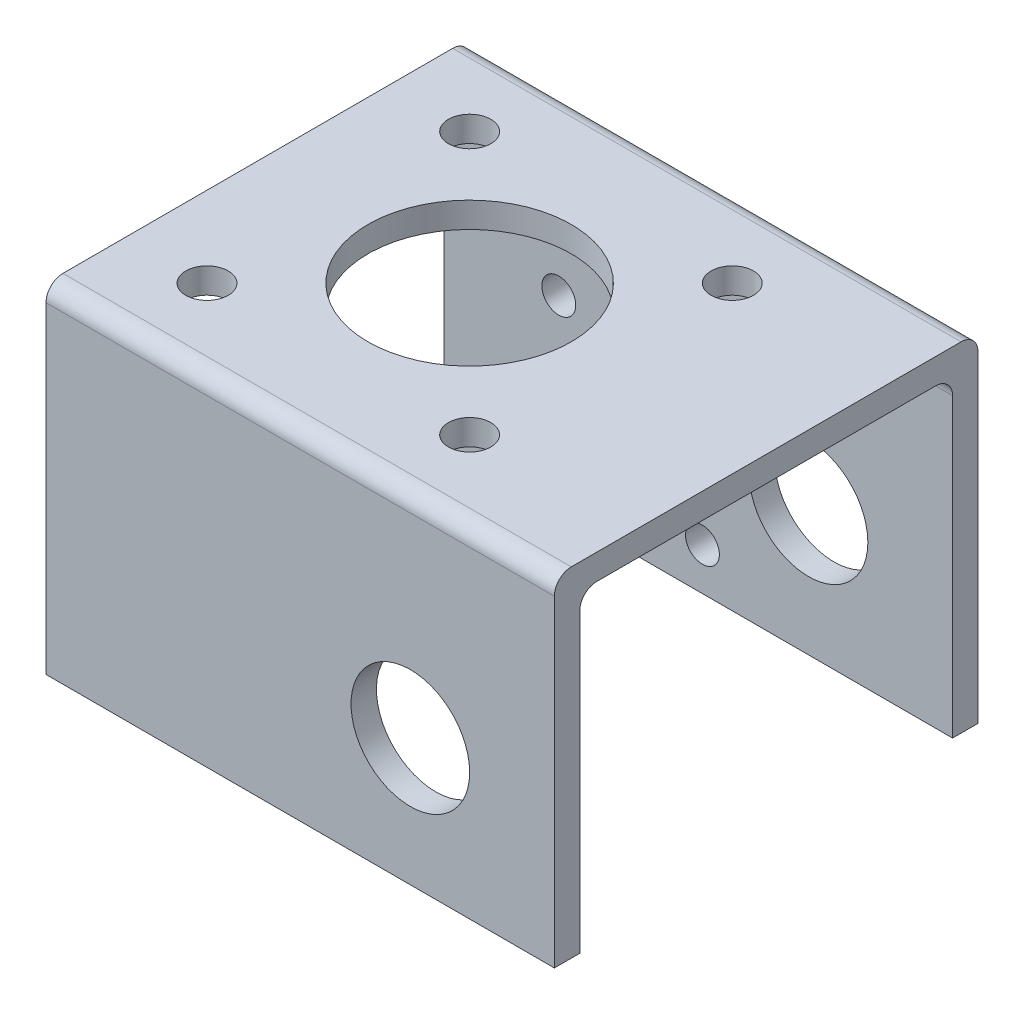
ISO-10303-21;
HEADER;
FILE_DESCRIPTION(('STEP AP214'),'2;1');
FILE_NAME('part.step','',(''),(''),'','','');
FILE_SCHEMA(('AUTOMOTIVE_DESIGN { 1 0 10303 214 1 1 1 1 }'));
ENDSEC;
DATA;
#1=APPLICATION_CONTEXT('core data for automotive mechanical design processes');
#2=APPLICATION_PROTOCOL_DEFINITION('international standard','automotive_design',2000,#1);
#3=PRODUCT_CONTEXT('',#1,'mechanical');
#4=PRODUCT('Part','Part','',(#3));
#5=PRODUCT_RELATED_PRODUCT_CATEGORY('part','',(#4));
#6=PRODUCT_DEFINITION_FORMATION('','',#4);
#7=PRODUCT_DEFINITION_CONTEXT('part definition',#1,'design');
#8=PRODUCT_DEFINITION('design','',#6,#7);
#9=PRODUCT_DEFINITION_SHAPE('','',#8);
#10=(LENGTH_UNIT() NAMED_UNIT(*) SI_UNIT(.MILLI.,.METRE.));
#11=(NAMED_UNIT(*) PLANE_ANGLE_UNIT() SI_UNIT($,.RADIAN.));
#12=(NAMED_UNIT(*) SI_UNIT($,.STERADIAN.) SOLID_ANGLE_UNIT());
#13=UNCERTAINTY_MEASURE_WITH_UNIT(LENGTH_MEASURE(1.E-05),#10,'distance_accuracy_value','');
#14=(GEOMETRIC_REPRESENTATION_CONTEXT(3) GLOBAL_UNCERTAINTY_ASSIGNED_CONTEXT((#13)) GLOBAL_UNIT_ASSIGNED_CONTEXT((#10,
#11,#12)) REPRESENTATION_CONTEXT('',''));
#15=CARTESIAN_POINT('',(0.,0.,0.));
#16=DIRECTION('',(0.,0.,1.));
#17=DIRECTION('',(1.,0.,0.));
#18=AXIS2_PLACEMENT_3D('',#15,#16,#17);
#19=CARTESIAN_POINT('',(60.,38.,0.));
#20=DIRECTION('',(0.,0.,-1.));
#21=DIRECTION('',(0.,1.,0.));
#22=AXIS2_PLACEMENT_3D('',#19,#20,#21);
#23=PLANE('',#22);
#24=CARTESIAN_POINT('',(43.,15.,0.));
#25=DIRECTION('',(0.,0.,1.));
#26=DIRECTION('',(1.,0.,0.));
#27=AXIS2_PLACEMENT_3D('',#24,#25,#26);
#28=CIRCLE('',#27,7.);
#29=CARTESIAN_POINT('',(50.,15.,0.));
#30=VERTEX_POINT('',#29);
#31=EDGE_CURVE('E262',#30,#30,#28,.T.);
#32=ORIENTED_EDGE('',*,*,#31,.F.);
#33=EDGE_LOOP('',(#32));
#34=FACE_BOUND('',#33,.T.);
#35=DIRECTION('',(0.,-1.,0.));
#36=VECTOR('',#35,1.);
#37=CARTESIAN_POINT('',(0.,38.,0.));
#38=LINE('',#37,#36);
#39=CARTESIAN_POINT('',(0.,38.,0.));
#40=VERTEX_POINT('',#39);
#41=CARTESIAN_POINT('',(0.,0.,0.));
#42=VERTEX_POINT('',#41);
#43=EDGE_CURVE('E153',#40,#42,#38,.T.);
#44=ORIENTED_EDGE('',*,*,#43,.T.);
#45=DIRECTION('',(-1.,0.,0.));
#46=VECTOR('',#45,1.);
#47=CARTESIAN_POINT('',(60.,0.,0.));
#48=LINE('',#47,#46);
#49=CARTESIAN_POINT('',(60.,0.,0.));
#50=VERTEX_POINT('',#49);
#51=EDGE_CURVE('E11',#50,#42,#48,.T.);
#52=ORIENTED_EDGE('',*,*,#51,.F.);
#53=DIRECTION('',(0.,-1.,0.));
#54=VECTOR('',#53,1.);
#55=CARTESIAN_POINT('',(60.,38.,0.));
#56=LINE('',#55,#54);
#57=CARTESIAN_POINT('',(60.,38.,0.));
#58=VERTEX_POINT('',#57);
#59=EDGE_CURVE('E176',#58,#50,#56,.T.);
#60=ORIENTED_EDGE('',*,*,#59,.F.);
#61=DIRECTION('',(-1.,0.,0.));
#62=VECTOR('',#61,1.);
#63=CARTESIAN_POINT('',(60.,38.,0.));
#64=LINE('',#63,#62);
#65=EDGE_CURVE('E149',#58,#40,#64,.T.);
#66=ORIENTED_EDGE('',*,*,#65,.T.);
#67=EDGE_LOOP('',(#44,#52,#60,#66));
#68=FACE_BOUND('',#67,.T.);
#69=ADVANCED_FACE('F33',(#34,#68),#23,.F.);
#70=CARTESIAN_POINT('',(60.,0.,0.));
#71=DIRECTION('',(0.,1.,0.));
#72=DIRECTION('',(0.,0.,1.));
#73=AXIS2_PLACEMENT_3D('',#70,#71,#72);
#74=PLANE('',#73);
#75=DIRECTION('',(0.,0.,-1.));
#76=VECTOR('',#75,1.);
#77=CARTESIAN_POINT('',(0.,0.,0.));
#78=LINE('',#77,#76);
#79=CARTESIAN_POINT('',(0.,0.,-3.));
#80=VERTEX_POINT('',#79);
#81=EDGE_CURVE('E156',#42,#80,#78,.T.);
#82=ORIENTED_EDGE('',*,*,#81,.T.);
#83=DIRECTION('',(-1.,0.,0.));
#84=VECTOR('',#83,1.);
#85=CARTESIAN_POINT('',(60.,0.,-3.));
#86=LINE('',#85,#84);
#87=CARTESIAN_POINT('',(60.,0.,-3.));
#88=VERTEX_POINT('',#87);
#89=EDGE_CURVE('E41',#88,#80,#86,.T.);
#90=ORIENTED_EDGE('',*,*,#89,.F.);
#91=DIRECTION('',(0.,0.,-1.));
#92=VECTOR('',#91,1.);
#93=CARTESIAN_POINT('',(60.,0.,0.));
#94=LINE('',#93,#92);
#95=EDGE_CURVE('E104',#50,#88,#94,.T.);
#96=ORIENTED_EDGE('',*,*,#95,.F.);
#97=ORIENTED_EDGE('',*,*,#51,.T.);
#98=EDGE_LOOP('',(#82,#90,#96,#97));
#99=FACE_BOUND('',#98,.T.);
#100=ADVANCED_FACE('F255',(#99),#74,.F.);
#101=CARTESIAN_POINT('',(60.,0.,-3.));
#102=DIRECTION('',(0.,0.,1.));
#103=DIRECTION('',(0.,-1.,0.));
#104=AXIS2_PLACEMENT_3D('',#101,#102,#103);
#105=PLANE('',#104);
#106=CARTESIAN_POINT('',(43.,15.,-3.));
#107=DIRECTION('',(0.,0.,1.));
#108=DIRECTION('',(0.,-1.,0.));
#109=AXIS2_PLACEMENT_3D('',#106,#107,#108);
#110=CIRCLE('',#109,7.);
#111=CARTESIAN_POINT('',(43.,8.,-3.));
#112=VERTEX_POINT('',#111);
#113=EDGE_CURVE('E276',#112,#112,#110,.T.);
#114=ORIENTED_EDGE('',*,*,#113,.T.);
#115=EDGE_LOOP('',(#114));
#116=FACE_BOUND('',#115,.T.);
#117=DIRECTION('',(0.,1.,0.));
#118=VECTOR('',#117,1.);
#119=CARTESIAN_POINT('',(0.,0.,-3.));
#120=LINE('',#119,#118);
#121=CARTESIAN_POINT('',(0.,35.,-3.));
#122=VERTEX_POINT('',#121);
#123=EDGE_CURVE('E159',#80,#122,#120,.T.);
#124=ORIENTED_EDGE('',*,*,#123,.T.);
#125=DIRECTION('',(-1.,0.,0.));
#126=VECTOR('',#125,1.);
#127=CARTESIAN_POINT('',(60.,35.,-3.));
#128=LINE('',#127,#126);
#129=CARTESIAN_POINT('',(60.,35.,-3.));
#130=VERTEX_POINT('',#129);
#131=EDGE_CURVE('E195',#130,#122,#128,.T.);
#132=ORIENTED_EDGE('',*,*,#131,.F.);
#133=DIRECTION('',(0.,1.,0.));
#134=VECTOR('',#133,1.);
#135=CARTESIAN_POINT('',(60.,0.,-3.));
#136=LINE('',#135,#134);
#137=EDGE_CURVE('E203',#88,#130,#136,.T.);
#138=ORIENTED_EDGE('',*,*,#137,.F.);
#139=ORIENTED_EDGE('',*,*,#89,.T.);
#140=EDGE_LOOP('',(#124,#132,#138,#139));
#141=FACE_BOUND('',#140,.T.);
#142=ADVANCED_FACE('F201',(#116,#141),#105,.F.);
#143=CARTESIAN_POINT('',(60.,35.,-5.));
#144=DIRECTION('',(-1.,0.,0.));
#145=DIRECTION('',(0.,0.,1.));
#146=AXIS2_PLACEMENT_3D('',#143,#144,#145);
#147=CYLINDRICAL_SURFACE('',#146,2.);
#148=CARTESIAN_POINT('',(0.,35.,-5.));
#149=DIRECTION('',(-1.,0.,0.));
#150=DIRECTION('',(0.,0.,1.));
#151=AXIS2_PLACEMENT_3D('',#148,#149,#150);
#152=CIRCLE('',#151,2.);
#153=CARTESIAN_POINT('',(0.,37.,-5.));
#154=VERTEX_POINT('',#153);
#155=EDGE_CURVE('E161',#122,#154,#152,.T.);
#156=ORIENTED_EDGE('',*,*,#155,.T.);
#157=DIRECTION('',(-1.,0.,0.));
#158=VECTOR('',#157,1.);
#159=CARTESIAN_POINT('',(60.,37.,-5.));
#160=LINE('',#159,#158);
#161=CARTESIAN_POINT('',(60.,37.,-5.));
#162=VERTEX_POINT('',#161);
#163=EDGE_CURVE('E192',#162,#154,#160,.T.);
#164=ORIENTED_EDGE('',*,*,#163,.F.);
#165=CARTESIAN_POINT('',(60.,35.,-5.));
#166=DIRECTION('',(-1.,0.,0.));
#167=DIRECTION('',(0.,0.,1.));
#168=AXIS2_PLACEMENT_3D('',#165,#166,#167);
#169=CIRCLE('',#168,2.);
#170=EDGE_CURVE('E221',#130,#162,#169,.T.);
#171=ORIENTED_EDGE('',*,*,#170,.F.);
#172=ORIENTED_EDGE('',*,*,#131,.T.);
#173=EDGE_LOOP('',(#156,#164,#171,#172));
#174=FACE_BOUND('',#173,.T.);
#175=ADVANCED_FACE('F212',(#174),#147,.F.);
#176=CARTESIAN_POINT('',(60.,37.,-5.));
#177=DIRECTION('',(0.,1.,0.));
#178=DIRECTION('',(0.,0.,1.));
#179=AXIS2_PLACEMENT_3D('',#176,#177,#178);
#180=PLANE('',#179);
#181=CARTESIAN_POINT('',(9.4999999999999,37.,-40.5));
#182=DIRECTION('',(0.,1.,0.));
#183=DIRECTION('',(0.,0.,1.));
#184=AXIS2_PLACEMENT_3D('',#181,#182,#183);
#185=CIRCLE('',#184,2.5);
#186=CARTESIAN_POINT('',(9.4999999999999,37.,-38.));
#187=VERTEX_POINT('',#186);
#188=EDGE_CURVE('E297',#187,#187,#185,.F.);
#189=ORIENTED_EDGE('',*,*,#188,.F.);
#190=EDGE_LOOP('',(#189));
#191=FACE_BOUND('',#190,.T.);
#192=CARTESIAN_POINT('',(40.4999999999999,37.,-40.5));
#193=DIRECTION('',(0.,1.,0.));
#194=DIRECTION('',(0.,0.,1.));
#195=AXIS2_PLACEMENT_3D('',#192,#193,#194);
#196=CIRCLE('',#195,2.5);
#197=CARTESIAN_POINT('',(40.4999999999999,37.,-38.));
#198=VERTEX_POINT('',#197);
#199=EDGE_CURVE('E291',#198,#198,#196,.F.);
#200=ORIENTED_EDGE('',*,*,#199,.F.);
#201=EDGE_LOOP('',(#200));
#202=FACE_BOUND('',#201,.T.);
#203=CARTESIAN_POINT('',(40.5,37.,-9.49999999999998));
#204=DIRECTION('',(0.,1.,0.));
#205=DIRECTION('',(0.,0.,1.));
#206=AXIS2_PLACEMENT_3D('',#203,#204,#205);
#207=CIRCLE('',#206,2.49999999999999);
#208=CARTESIAN_POINT('',(40.5,37.,-6.99999999999999));
#209=VERTEX_POINT('',#208);
#210=EDGE_CURVE('E284',#209,#209,#207,.F.);
#211=ORIENTED_EDGE('',*,*,#210,.F.);
#212=EDGE_LOOP('',(#211));
#213=FACE_BOUND('',#212,.T.);
#214=CARTESIAN_POINT('',(25.,37.,-25.));
#215=DIRECTION('',(0.,1.,0.));
#216=DIRECTION('',(0.,0.,1.));
#217=AXIS2_PLACEMENT_3D('',#214,#215,#216);
#218=CIRCLE('',#217,12.);
#219=CARTESIAN_POINT('',(25.,37.,-13.));
#220=VERTEX_POINT('',#219);
#221=EDGE_CURVE('E283',#220,#220,#218,.F.);
#222=ORIENTED_EDGE('',*,*,#221,.F.);
#223=EDGE_LOOP('',(#222));
#224=FACE_BOUND('',#223,.T.);
#225=CARTESIAN_POINT('',(9.5,37.,-9.49999999999998));
#226=DIRECTION('',(0.,1.,0.));
#227=DIRECTION('',(0.,0.,1.));
#228=AXIS2_PLACEMENT_3D('',#225,#226,#227);
#229=CIRCLE('',#228,2.5);
#230=CARTESIAN_POINT('',(9.5,37.,-6.99999999999998));
#231=VERTEX_POINT('',#230);
#232=EDGE_CURVE('E157',#231,#231,#229,.F.);
#233=ORIENTED_EDGE('',*,*,#232,.F.);
#234=EDGE_LOOP('',(#233));
#235=FACE_BOUND('',#234,.T.);
#236=DIRECTION('',(0.,0.,-1.));
#237=VECTOR('',#236,1.);
#238=CARTESIAN_POINT('',(0.,37.,-5.));
#239=LINE('',#238,#237);
#240=CARTESIAN_POINT('',(0.,37.,-45.));
#241=VERTEX_POINT('',#240);
#242=EDGE_CURVE('E163',#154,#241,#239,.T.);
#243=ORIENTED_EDGE('',*,*,#242,.T.);
#244=DIRECTION('',(-1.,0.,0.));
#245=VECTOR('',#244,1.);
#246=CARTESIAN_POINT('',(60.,37.,-45.));
#247=LINE('',#246,#245);
#248=CARTESIAN_POINT('',(60.,37.,-45.));
#249=VERTEX_POINT('',#248);
#250=EDGE_CURVE('E189',#249,#241,#247,.T.);
#251=ORIENTED_EDGE('',*,*,#250,.F.);
#252=DIRECTION('',(0.,0.,-1.));
#253=VECTOR('',#252,1.);
#254=CARTESIAN_POINT('',(60.,37.,-5.));
#255=LINE('',#254,#253);
#256=EDGE_CURVE('E218',#162,#249,#255,.T.);
#257=ORIENTED_EDGE('',*,*,#256,.F.);
#258=ORIENTED_EDGE('',*,*,#163,.T.);
#259=EDGE_LOOP('',(#243,#251,#257,#258));
#260=FACE_BOUND('',#259,.T.);
#261=ADVANCED_FACE('F216',(#191,#202,#213,#224,#235,#260),#180,.F.);
#262=CARTESIAN_POINT('',(60.,35.,-45.));
#263=DIRECTION('',(-1.,0.,0.));
#264=DIRECTION('',(0.,0.,1.));
#265=AXIS2_PLACEMENT_3D('',#262,#263,#264);
#266=CYLINDRICAL_SURFACE('',#265,2.);
#267=CARTESIAN_POINT('',(0.,35.,-45.));
#268=DIRECTION('',(-1.,0.,0.));
#269=DIRECTION('',(0.,0.,1.));
#270=AXIS2_PLACEMENT_3D('',#267,#268,#269);
#271=CIRCLE('',#270,2.);
#272=CARTESIAN_POINT('',(0.,35.,-47.));
#273=VERTEX_POINT('',#272);
#274=EDGE_CURVE('E165',#241,#273,#271,.T.);
#275=ORIENTED_EDGE('',*,*,#274,.T.);
#276=DIRECTION('',(-1.,0.,0.));
#277=VECTOR('',#276,1.);
#278=CARTESIAN_POINT('',(60.,35.,-47.));
#279=LINE('',#278,#277);
#280=CARTESIAN_POINT('',(60.,35.,-47.));
#281=VERTEX_POINT('',#280);
#282=EDGE_CURVE('E186',#281,#273,#279,.T.);
#283=ORIENTED_EDGE('',*,*,#282,.F.);
#284=CARTESIAN_POINT('',(60.,35.,-45.));
#285=DIRECTION('',(-1.,0.,0.));
#286=DIRECTION('',(0.,0.,1.));
#287=AXIS2_PLACEMENT_3D('',#284,#285,#286);
#288=CIRCLE('',#287,2.);
#289=EDGE_CURVE('E220',#249,#281,#288,.T.);
#290=ORIENTED_EDGE('',*,*,#289,.F.);
#291=ORIENTED_EDGE('',*,*,#250,.T.);
#292=EDGE_LOOP('',(#275,#283,#290,#291));
#293=FACE_BOUND('',#292,.T.);
#294=ADVANCED_FACE('F314',(#293),#266,.F.);
#295=CARTESIAN_POINT('',(60.,35.,-47.));
#296=DIRECTION('',(0.,0.,-1.));
#297=DIRECTION('',(0.,1.,0.));
#298=AXIS2_PLACEMENT_3D('',#295,#296,#297);
#299=PLANE('',#298);
#300=CARTESIAN_POINT('',(13.525,21.9911006117909,-47.));
#301=DIRECTION('',(0.,0.,-1.));
#302=DIRECTION('',(0.,1.,0.));
#303=AXIS2_PLACEMENT_3D('',#300,#301,#302);
#304=CIRCLE('',#303,2.);
#305=CARTESIAN_POINT('',(13.525,23.9911006117909,-47.));
#306=VERTEX_POINT('',#305);
#307=EDGE_CURVE('E470',#306,#306,#304,.F.);
#308=ORIENTED_EDGE('',*,*,#307,.F.);
#309=EDGE_LOOP('',(#308));
#310=FACE_BOUND('',#309,.T.);
#311=CARTESIAN_POINT('',(30.475,21.9911006117909,-47.));
#312=DIRECTION('',(0.,0.,-1.));
#313=DIRECTION('',(0.,1.,0.));
#314=AXIS2_PLACEMENT_3D('',#311,#312,#313);
#315=CIRCLE('',#314,2.);
#316=CARTESIAN_POINT('',(30.475,23.9911006117909,-47.));
#317=VERTEX_POINT('',#316);
#318=EDGE_CURVE('E472',#317,#317,#315,.F.);
#319=ORIENTED_EDGE('',*,*,#318,.F.);
#320=EDGE_LOOP('',(#319));
#321=FACE_BOUND('',#320,.T.);
#322=CARTESIAN_POINT('',(30.475,5.00000000000001,-47.));
#323=DIRECTION('',(0.,0.,-1.));
#324=DIRECTION('',(0.,1.,0.));
#325=AXIS2_PLACEMENT_3D('',#322,#323,#324);
#326=CIRCLE('',#325,2.);
#327=CARTESIAN_POINT('',(30.475,7.00000000000001,-47.));
#328=VERTEX_POINT('',#327);
#329=EDGE_CURVE('E483',#328,#328,#326,.F.);
#330=ORIENTED_EDGE('',*,*,#329,.F.);
#331=EDGE_LOOP('',(#330));
#332=FACE_BOUND('',#331,.T.);
#333=CARTESIAN_POINT('',(13.525,5.00000000000001,-47.));
#334=DIRECTION('',(0.,0.,-1.));
#335=DIRECTION('',(0.,1.,0.));
#336=AXIS2_PLACEMENT_3D('',#333,#334,#335);
#337=CIRCLE('',#336,2.);
#338=CARTESIAN_POINT('',(13.525,7.00000000000001,-47.));
#339=VERTEX_POINT('',#338);
#340=EDGE_CURVE('E271',#339,#339,#337,.F.);
#341=ORIENTED_EDGE('',*,*,#340,.F.);
#342=EDGE_LOOP('',(#341));
#343=FACE_BOUND('',#342,.T.);
#344=CARTESIAN_POINT('',(43.,15.,-47.));
#345=DIRECTION('',(0.,0.,-1.));
#346=DIRECTION('',(0.,1.,0.));
#347=AXIS2_PLACEMENT_3D('',#344,#345,#346);
#348=CIRCLE('',#347,7.);
#349=CARTESIAN_POINT('',(43.,22.,-47.));
#350=VERTEX_POINT('',#349);
#351=EDGE_CURVE('E268',#350,#350,#348,.T.);
#352=ORIENTED_EDGE('',*,*,#351,.T.);
#353=EDGE_LOOP('',(#352));
#354=FACE_BOUND('',#353,.T.);
#355=DIRECTION('',(0.,-1.,0.));
#356=VECTOR('',#355,1.);
#357=CARTESIAN_POINT('',(0.,35.,-47.));
#358=LINE('',#357,#356);
#359=CARTESIAN_POINT('',(0.,0.,-47.));
#360=VERTEX_POINT('',#359);
#361=EDGE_CURVE('E167',#273,#360,#358,.T.);
#362=ORIENTED_EDGE('',*,*,#361,.T.);
#363=DIRECTION('',(-1.,0.,0.));
#364=VECTOR('',#363,1.);
#365=CARTESIAN_POINT('',(60.,0.,-47.));
#366=LINE('',#365,#364);
#367=CARTESIAN_POINT('',(60.,0.,-47.));
#368=VERTEX_POINT('',#367);
#369=EDGE_CURVE('E183',#368,#360,#366,.T.);
#370=ORIENTED_EDGE('',*,*,#369,.F.);
#371=DIRECTION('',(0.,-1.,0.));
#372=VECTOR('',#371,1.);
#373=CARTESIAN_POINT('',(60.,35.,-47.));
#374=LINE('',#373,#372);
#375=EDGE_CURVE('E223',#281,#368,#374,.T.);
#376=ORIENTED_EDGE('',*,*,#375,.F.);
#377=ORIENTED_EDGE('',*,*,#282,.T.);
#378=EDGE_LOOP('',(#362,#370,#376,#377));
#379=FACE_BOUND('',#378,.T.);
#380=ADVANCED_FACE('F321',(#310,#321,#332,#343,#354,#379),#299,.F.);
#381=CARTESIAN_POINT('',(60.,0.,-47.));
#382=DIRECTION('',(0.,1.,0.));
#383=DIRECTION('',(0.,0.,1.));
#384=AXIS2_PLACEMENT_3D('',#381,#382,#383);
#385=PLANE('',#384);
#386=DIRECTION('',(0.,0.,-1.));
#387=VECTOR('',#386,1.);
#388=CARTESIAN_POINT('',(0.,0.,-47.));
#389=LINE('',#388,#387);
#390=CARTESIAN_POINT('',(0.,0.,-50.));
#391=VERTEX_POINT('',#390);
#392=EDGE_CURVE('E169',#360,#391,#389,.T.);
#393=ORIENTED_EDGE('',*,*,#392,.T.);
#394=DIRECTION('',(-1.,0.,0.));
#395=VECTOR('',#394,1.);
#396=CARTESIAN_POINT('',(60.,0.,-50.));
#397=LINE('',#396,#395);
#398=CARTESIAN_POINT('',(60.,0.,-50.));
#399=VERTEX_POINT('',#398);
#400=EDGE_CURVE('E180',#399,#391,#397,.T.);
#401=ORIENTED_EDGE('',*,*,#400,.F.);
#402=DIRECTION('',(0.,0.,-1.));
#403=VECTOR('',#402,1.);
#404=CARTESIAN_POINT('',(60.,0.,-47.));
#405=LINE('',#404,#403);
#406=EDGE_CURVE('E229',#368,#399,#405,.T.);
#407=ORIENTED_EDGE('',*,*,#406,.F.);
#408=ORIENTED_EDGE('',*,*,#369,.T.);
#409=EDGE_LOOP('',(#393,#401,#407,#408));
#410=FACE_BOUND('',#409,.T.);
#411=ADVANCED_FACE('F235',(#410),#385,.F.);
#412=CARTESIAN_POINT('',(60.,0.,-50.));
#413=DIRECTION('',(0.,0.,1.));
#414=DIRECTION('',(0.,-1.,0.));
#415=AXIS2_PLACEMENT_3D('',#412,#413,#414);
#416=PLANE('',#415);
#417=CARTESIAN_POINT('',(13.525,21.9911006117909,-50.));
#418=DIRECTION('',(0.,0.,-1.));
#419=DIRECTION('',(1.,0.,0.));
#420=AXIS2_PLACEMENT_3D('',#417,#418,#419);
#421=CIRCLE('',#420,2.);
#422=CARTESIAN_POINT('',(15.525,21.9911006117909,-50.));
#423=VERTEX_POINT('',#422);
#424=EDGE_CURVE('E467',#423,#423,#421,.T.);
#425=ORIENTED_EDGE('',*,*,#424,.F.);
#426=EDGE_LOOP('',(#425));
#427=FACE_BOUND('',#426,.T.);
#428=CARTESIAN_POINT('',(30.475,21.9911006117909,-50.));
#429=DIRECTION('',(0.,0.,-1.));
#430=DIRECTION('',(-1.,0.,0.));
#431=AXIS2_PLACEMENT_3D('',#428,#429,#430);
#432=CIRCLE('',#431,2.);
#433=CARTESIAN_POINT('',(28.475,21.9911006117909,-50.));
#434=VERTEX_POINT('',#433);
#435=EDGE_CURVE('E475',#434,#434,#432,.T.);
#436=ORIENTED_EDGE('',*,*,#435,.F.);
#437=EDGE_LOOP('',(#436));
#438=FACE_BOUND('',#437,.T.);
#439=CARTESIAN_POINT('',(30.475,5.00000000000001,-50.));
#440=DIRECTION('',(0.,0.,-1.));
#441=DIRECTION('',(1.,0.,0.));
#442=AXIS2_PLACEMENT_3D('',#439,#440,#441);
#443=CIRCLE('',#442,2.);
#444=CARTESIAN_POINT('',(32.475,5.00000000000001,-50.));
#445=VERTEX_POINT('',#444);
#446=EDGE_CURVE('E479',#445,#445,#443,.T.);
#447=ORIENTED_EDGE('',*,*,#446,.F.);
#448=EDGE_LOOP('',(#447));
#449=FACE_BOUND('',#448,.T.);
#450=CARTESIAN_POINT('',(13.525,5.00000000000001,-50.));
#451=DIRECTION('',(0.,0.,-1.));
#452=DIRECTION('',(-1.,0.,0.));
#453=AXIS2_PLACEMENT_3D('',#450,#451,#452);
#454=CIRCLE('',#453,2.);
#455=CARTESIAN_POINT('',(11.525,5.00000000000001,-50.));
#456=VERTEX_POINT('',#455);
#457=EDGE_CURVE('E265',#456,#456,#454,.T.);
#458=ORIENTED_EDGE('',*,*,#457,.F.);
#459=EDGE_LOOP('',(#458));
#460=FACE_BOUND('',#459,.T.);
#461=CARTESIAN_POINT('',(43.,15.,-50.));
#462=DIRECTION('',(0.,0.,1.));
#463=DIRECTION('',(1.,0.,0.));
#464=AXIS2_PLACEMENT_3D('',#461,#462,#463);
#465=CIRCLE('',#464,7.);
#466=CARTESIAN_POINT('',(50.,15.,-50.));
#467=VERTEX_POINT('',#466);
#468=EDGE_CURVE('E264',#467,#467,#465,.T.);
#469=ORIENTED_EDGE('',*,*,#468,.T.);
#470=EDGE_LOOP('',(#469));
#471=FACE_BOUND('',#470,.T.);
#472=DIRECTION('',(0.,1.,0.));
#473=VECTOR('',#472,1.);
#474=CARTESIAN_POINT('',(0.,0.,-50.));
#475=LINE('',#474,#473);
#476=CARTESIAN_POINT('',(0.,38.,-50.));
#477=VERTEX_POINT('',#476);
#478=EDGE_CURVE('E171',#391,#477,#475,.T.);
#479=ORIENTED_EDGE('',*,*,#478,.T.);
#480=DIRECTION('',(-1.,0.,0.));
#481=VECTOR('',#480,1.);
#482=CARTESIAN_POINT('',(60.,38.,-50.));
#483=LINE('',#482,#481);
#484=CARTESIAN_POINT('',(60.,38.,-50.));
#485=VERTEX_POINT('',#484);
#486=EDGE_CURVE('E144',#485,#477,#483,.T.);
#487=ORIENTED_EDGE('',*,*,#486,.F.);
#488=DIRECTION('',(0.,1.,0.));
#489=VECTOR('',#488,1.);
#490=CARTESIAN_POINT('',(60.,0.,-50.));
#491=LINE('',#490,#489);
#492=EDGE_CURVE('E135',#399,#485,#491,.T.);
#493=ORIENTED_EDGE('',*,*,#492,.F.);
#494=ORIENTED_EDGE('',*,*,#400,.T.);
#495=EDGE_LOOP('',(#479,#487,#493,#494));
#496=FACE_BOUND('',#495,.T.);
#497=ADVANCED_FACE('F239',(#427,#438,#449,#460,#471,#496),#416,.F.);
#498=CARTESIAN_POINT('',(60.,38.,-48.));
#499=DIRECTION('',(-1.,0.,0.));
#500=DIRECTION('',(0.,0.,1.));
#501=AXIS2_PLACEMENT_3D('',#498,#499,#500);
#502=CYLINDRICAL_SURFACE('',#501,2.);
#503=CARTESIAN_POINT('',(0.,38.,-48.));
#504=DIRECTION('',(1.,0.,0.));
#505=DIRECTION('',(0.,0.,-1.));
#506=AXIS2_PLACEMENT_3D('',#503,#504,#505);
#507=CIRCLE('',#506,2.);
#508=CARTESIAN_POINT('',(0.,40.,-48.));
#509=VERTEX_POINT('',#508);
#510=EDGE_CURVE('E143',#477,#509,#507,.T.);
#511=ORIENTED_EDGE('',*,*,#510,.T.);
#512=DIRECTION('',(-1.,0.,0.));
#513=VECTOR('',#512,1.);
#514=CARTESIAN_POINT('',(60.,40.,-48.));
#515=LINE('',#514,#513);
#516=CARTESIAN_POINT('',(60.,40.,-48.));
#517=VERTEX_POINT('',#516);
#518=EDGE_CURVE('E140',#517,#509,#515,.T.);
#519=ORIENTED_EDGE('',*,*,#518,.F.);
#520=CARTESIAN_POINT('',(60.,38.,-48.));
#521=DIRECTION('',(1.,0.,0.));
#522=DIRECTION('',(0.,0.,-1.));
#523=AXIS2_PLACEMENT_3D('',#520,#521,#522);
#524=CIRCLE('',#523,2.);
#525=EDGE_CURVE('E129',#485,#517,#524,.T.);
#526=ORIENTED_EDGE('',*,*,#525,.F.);
#527=ORIENTED_EDGE('',*,*,#486,.T.);
#528=EDGE_LOOP('',(#511,#519,#526,#527));
#529=FACE_BOUND('',#528,.T.);
#530=ADVANCED_FACE('F141',(#529),#502,.T.);
#531=CARTESIAN_POINT('',(60.,40.,-48.));
#532=DIRECTION('',(0.,-1.,0.));
#533=DIRECTION('',(0.,0.,-1.));
#534=AXIS2_PLACEMENT_3D('',#531,#532,#533);
#535=PLANE('',#534);
#536=CARTESIAN_POINT('',(9.4999999999999,40.,-40.5));
#537=DIRECTION('',(0.,1.,0.));
#538=DIRECTION('',(0.,0.,1.));
#539=AXIS2_PLACEMENT_3D('',#536,#537,#538);
#540=CIRCLE('',#539,2.5);
#541=CARTESIAN_POINT('',(9.4999999999999,40.,-38.));
#542=VERTEX_POINT('',#541);
#543=EDGE_CURVE('E279',#542,#542,#540,.T.);
#544=ORIENTED_EDGE('',*,*,#543,.F.);
#545=EDGE_LOOP('',(#544));
#546=FACE_BOUND('',#545,.T.);
#547=CARTESIAN_POINT('',(40.4999999999999,40.,-40.5));
#548=DIRECTION('',(0.,1.,0.));
#549=DIRECTION('',(0.,0.,1.));
#550=AXIS2_PLACEMENT_3D('',#547,#548,#549);
#551=CIRCLE('',#550,2.5);
#552=CARTESIAN_POINT('',(40.4999999999999,40.,-38.));
#553=VERTEX_POINT('',#552);
#554=EDGE_CURVE('E294',#553,#553,#551,.T.);
#555=ORIENTED_EDGE('',*,*,#554,.F.);
#556=EDGE_LOOP('',(#555));
#557=FACE_BOUND('',#556,.T.);
#558=CARTESIAN_POINT('',(40.5,40.,-9.49999999999998));
#559=DIRECTION('',(0.,1.,0.));
#560=DIRECTION('',(0.,0.,1.));
#561=AXIS2_PLACEMENT_3D('',#558,#559,#560);
#562=CIRCLE('',#561,2.49999999999999);
#563=CARTESIAN_POINT('',(40.5,40.,-6.99999999999999));
#564=VERTEX_POINT('',#563);
#565=EDGE_CURVE('E288',#564,#564,#562,.T.);
#566=ORIENTED_EDGE('',*,*,#565,.F.);
#567=EDGE_LOOP('',(#566));
#568=FACE_BOUND('',#567,.T.);
#569=CARTESIAN_POINT('',(25.,40.,-25.));
#570=DIRECTION('',(0.,1.,0.));
#571=DIRECTION('',(0.,0.,1.));
#572=AXIS2_PLACEMENT_3D('',#569,#570,#571);
#573=CIRCLE('',#572,12.);
#574=CARTESIAN_POINT('',(25.,40.,-13.));
#575=VERTEX_POINT('',#574);
#576=EDGE_CURVE('E280',#575,#575,#573,.T.);
#577=ORIENTED_EDGE('',*,*,#576,.F.);
#578=EDGE_LOOP('',(#577));
#579=FACE_BOUND('',#578,.T.);
#580=CARTESIAN_POINT('',(9.5,40.,-9.49999999999998));
#581=DIRECTION('',(0.,1.,0.));
#582=DIRECTION('',(0.,0.,1.));
#583=AXIS2_PLACEMENT_3D('',#580,#581,#582);
#584=CIRCLE('',#583,2.5);
#585=CARTESIAN_POINT('',(9.5,40.,-6.99999999999998));
#586=VERTEX_POINT('',#585);
#587=EDGE_CURVE('E287',#586,#586,#584,.T.);
#588=ORIENTED_EDGE('',*,*,#587,.F.);
#589=EDGE_LOOP('',(#588));
#590=FACE_BOUND('',#589,.T.);
#591=DIRECTION('',(0.,0.,1.));
#592=VECTOR('',#591,1.);
#593=CARTESIAN_POINT('',(0.,40.,-48.));
#594=LINE('',#593,#592);
#595=CARTESIAN_POINT('',(0.,40.,-1.99999999999999));
#596=VERTEX_POINT('',#595);
#597=EDGE_CURVE('E90',#509,#596,#594,.T.);
#598=ORIENTED_EDGE('',*,*,#597,.T.);
#599=DIRECTION('',(-1.,0.,0.));
#600=VECTOR('',#599,1.);
#601=CARTESIAN_POINT('',(60.,40.,-1.99999999999999));
#602=LINE('',#601,#600);
#603=CARTESIAN_POINT('',(60.,40.,-1.99999999999999));
#604=VERTEX_POINT('',#603);
#605=EDGE_CURVE('E145',#604,#596,#602,.T.);
#606=ORIENTED_EDGE('',*,*,#605,.F.);
#607=DIRECTION('',(0.,0.,1.));
#608=VECTOR('',#607,1.);
#609=CARTESIAN_POINT('',(60.,40.,-48.));
#610=LINE('',#609,#608);
#611=EDGE_CURVE('E133',#517,#604,#610,.T.);
#612=ORIENTED_EDGE('',*,*,#611,.F.);
#613=ORIENTED_EDGE('',*,*,#518,.T.);
#614=EDGE_LOOP('',(#598,#606,#612,#613));
#615=FACE_BOUND('',#614,.T.);
#616=ADVANCED_FACE('F147',(#546,#557,#568,#579,#590,#615),#535,.F.);
#617=CARTESIAN_POINT('',(60.,38.,-1.99999999999998));
#618=DIRECTION('',(-1.,0.,0.));
#619=DIRECTION('',(0.,0.,1.));
#620=AXIS2_PLACEMENT_3D('',#617,#618,#619);
#621=CYLINDRICAL_SURFACE('',#620,2.);
#622=CARTESIAN_POINT('',(0.,38.,-1.99999999999998));
#623=DIRECTION('',(1.,0.,0.));
#624=DIRECTION('',(0.,0.,-1.));
#625=AXIS2_PLACEMENT_3D('',#622,#623,#624);
#626=CIRCLE('',#625,2.);
#627=EDGE_CURVE('E96',#596,#40,#626,.T.);
#628=ORIENTED_EDGE('',*,*,#627,.T.);
#629=ORIENTED_EDGE('',*,*,#65,.F.);
#630=CARTESIAN_POINT('',(60.,38.,-1.99999999999998));
#631=DIRECTION('',(1.,0.,0.));
#632=DIRECTION('',(0.,0.,-1.));
#633=AXIS2_PLACEMENT_3D('',#630,#631,#632);
#634=CIRCLE('',#633,2.);
#635=EDGE_CURVE('E49',#604,#58,#634,.T.);
#636=ORIENTED_EDGE('',*,*,#635,.F.);
#637=ORIENTED_EDGE('',*,*,#605,.T.);
#638=EDGE_LOOP('',(#628,#629,#636,#637));
#639=FACE_BOUND('',#638,.T.);
#640=ADVANCED_FACE('F243',(#639),#621,.T.);
#641=CARTESIAN_POINT('',(60.,35.,-5.));
#642=DIRECTION('',(-1.,0.,0.));
#643=DIRECTION('',(0.,0.,1.));
#644=AXIS2_PLACEMENT_3D('',#641,#642,#643);
#645=PLANE('',#644);
#646=ORIENTED_EDGE('',*,*,#59,.T.);
#647=ORIENTED_EDGE('',*,*,#95,.T.);
#648=ORIENTED_EDGE('',*,*,#137,.T.);
#649=ORIENTED_EDGE('',*,*,#170,.T.);
#650=ORIENTED_EDGE('',*,*,#256,.T.);
#651=ORIENTED_EDGE('',*,*,#289,.T.);
#652=ORIENTED_EDGE('',*,*,#375,.T.);
#653=ORIENTED_EDGE('',*,*,#406,.T.);
#654=ORIENTED_EDGE('',*,*,#492,.T.);
#655=ORIENTED_EDGE('',*,*,#525,.T.);
#656=ORIENTED_EDGE('',*,*,#611,.T.);
#657=ORIENTED_EDGE('',*,*,#635,.T.);
#658=EDGE_LOOP('',(#646,#647,#648,#649,#650,#651,#652,#653,#654,#655,#656,#657));
#659=FACE_BOUND('',#658,.T.);
#660=ADVANCED_FACE('F131',(#659),#645,.F.);
#661=CARTESIAN_POINT('',(0.,35.,-5.));
#662=DIRECTION('',(-1.,0.,0.));
#663=DIRECTION('',(0.,0.,1.));
#664=AXIS2_PLACEMENT_3D('',#661,#662,#663);
#665=PLANE('',#664);
#666=ORIENTED_EDGE('',*,*,#43,.F.);
#667=ORIENTED_EDGE('',*,*,#627,.F.);
#668=ORIENTED_EDGE('',*,*,#597,.F.);
#669=ORIENTED_EDGE('',*,*,#510,.F.);
#670=ORIENTED_EDGE('',*,*,#478,.F.);
#671=ORIENTED_EDGE('',*,*,#392,.F.);
#672=ORIENTED_EDGE('',*,*,#361,.F.);
#673=ORIENTED_EDGE('',*,*,#274,.F.);
#674=ORIENTED_EDGE('',*,*,#242,.F.);
#675=ORIENTED_EDGE('',*,*,#155,.F.);
#676=ORIENTED_EDGE('',*,*,#123,.F.);
#677=ORIENTED_EDGE('',*,*,#81,.F.);
#678=EDGE_LOOP('',(#666,#667,#668,#669,#670,#671,#672,#673,#674,#675,#676,#677));
#679=FACE_BOUND('',#678,.T.);
#680=ADVANCED_FACE('F207',(#679),#665,.T.);
#681=CARTESIAN_POINT('',(9.5,-0.001000000000001,-9.49999999999998));
#682=DIRECTION('',(0.,1.,0.));
#683=DIRECTION('',(0.,0.,1.));
#684=AXIS2_PLACEMENT_3D('',#681,#682,#683);
#685=CYLINDRICAL_SURFACE('',#684,2.5);
#686=ORIENTED_EDGE('',*,*,#587,.T.);
#687=EDGE_LOOP('',(#686));
#688=FACE_BOUND('',#687,.T.);
#689=ORIENTED_EDGE('',*,*,#232,.T.);
#690=EDGE_LOOP('',(#689));
#691=FACE_BOUND('',#690,.T.);
#692=ADVANCED_FACE('F311',(#688,#691),#685,.F.);
#693=CARTESIAN_POINT('',(25.,-0.001000000000001,-25.));
#694=DIRECTION('',(0.,1.,0.));
#695=DIRECTION('',(0.,0.,1.));
#696=AXIS2_PLACEMENT_3D('',#693,#694,#695);
#697=CYLINDRICAL_SURFACE('',#696,12.);
#698=ORIENTED_EDGE('',*,*,#576,.T.);
#699=EDGE_LOOP('',(#698));
#700=FACE_BOUND('',#699,.T.);
#701=ORIENTED_EDGE('',*,*,#221,.T.);
#702=EDGE_LOOP('',(#701));
#703=FACE_BOUND('',#702,.T.);
#704=ADVANCED_FACE('F351',(#700,#703),#697,.F.);
#705=CARTESIAN_POINT('',(40.5,-0.001000000000001,-9.49999999999998));
#706=DIRECTION('',(0.,1.,0.));
#707=DIRECTION('',(0.,0.,1.));
#708=AXIS2_PLACEMENT_3D('',#705,#706,#707);
#709=CYLINDRICAL_SURFACE('',#708,2.49999999999999);
#710=ORIENTED_EDGE('',*,*,#565,.T.);
#711=EDGE_LOOP('',(#710));
#712=FACE_BOUND('',#711,.T.);
#713=ORIENTED_EDGE('',*,*,#210,.T.);
#714=EDGE_LOOP('',(#713));
#715=FACE_BOUND('',#714,.T.);
#716=ADVANCED_FACE('F354',(#712,#715),#709,.F.);
#717=CARTESIAN_POINT('',(40.4999999999999,-0.001000000000001,-40.5));
#718=DIRECTION('',(0.,1.,0.));
#719=DIRECTION('',(0.,0.,1.));
#720=AXIS2_PLACEMENT_3D('',#717,#718,#719);
#721=CYLINDRICAL_SURFACE('',#720,2.5);
#722=ORIENTED_EDGE('',*,*,#554,.T.);
#723=EDGE_LOOP('',(#722));
#724=FACE_BOUND('',#723,.T.);
#725=ORIENTED_EDGE('',*,*,#199,.T.);
#726=EDGE_LOOP('',(#725));
#727=FACE_BOUND('',#726,.T.);
#728=ADVANCED_FACE('F358',(#724,#727),#721,.F.);
#729=CARTESIAN_POINT('',(9.4999999999999,-0.001000000000001,-40.5));
#730=DIRECTION('',(0.,1.,0.));
#731=DIRECTION('',(0.,0.,1.));
#732=AXIS2_PLACEMENT_3D('',#729,#730,#731);
#733=CYLINDRICAL_SURFACE('',#732,2.5);
#734=ORIENTED_EDGE('',*,*,#543,.T.);
#735=EDGE_LOOP('',(#734));
#736=FACE_BOUND('',#735,.T.);
#737=ORIENTED_EDGE('',*,*,#188,.T.);
#738=EDGE_LOOP('',(#737));
#739=FACE_BOUND('',#738,.T.);
#740=ADVANCED_FACE('F347',(#736,#739),#733,.F.);
#741=CARTESIAN_POINT('',(43.,15.,-50.));
#742=DIRECTION('',(0.,0.,1.));
#743=DIRECTION('',(1.,0.,0.));
#744=AXIS2_PLACEMENT_3D('',#741,#742,#743);
#745=CYLINDRICAL_SURFACE('',#744,7.);
#746=ORIENTED_EDGE('',*,*,#468,.F.);
#747=EDGE_LOOP('',(#746));
#748=FACE_BOUND('',#747,.T.);
#749=ORIENTED_EDGE('',*,*,#351,.F.);
#750=EDGE_LOOP('',(#749));
#751=FACE_BOUND('',#750,.T.);
#752=ADVANCED_FACE('F338',(#748,#751),#745,.F.);
#753=ORIENTED_EDGE('',*,*,#31,.T.);
#754=EDGE_LOOP('',(#753));
#755=FACE_BOUND('',#754,.T.);
#756=ORIENTED_EDGE('',*,*,#113,.F.);
#757=EDGE_LOOP('',(#756));
#758=FACE_BOUND('',#757,.T.);
#759=ADVANCED_FACE('F335',(#755,#758),#745,.F.);
#760=CARTESIAN_POINT('',(13.525,5.00000000000001,0.00100000000002182));
#761=DIRECTION('',(0.,0.,-1.));
#762=DIRECTION('',(-1.,0.,0.));
#763=AXIS2_PLACEMENT_3D('',#760,#761,#762);
#764=CYLINDRICAL_SURFACE('',#763,2.);
#765=ORIENTED_EDGE('',*,*,#457,.T.);
#766=EDGE_LOOP('',(#765));
#767=FACE_BOUND('',#766,.T.);
#768=ORIENTED_EDGE('',*,*,#340,.T.);
#769=EDGE_LOOP('',(#768));
#770=FACE_BOUND('',#769,.T.);
#771=ADVANCED_FACE('F337',(#767,#770),#764,.F.);
#772=CARTESIAN_POINT('',(30.475,5.00000000000001,0.00100000000002182));
#773=DIRECTION('',(0.,0.,-1.));
#774=DIRECTION('',(-1.,0.,0.));
#775=AXIS2_PLACEMENT_3D('',#772,#773,#774);
#776=CYLINDRICAL_SURFACE('',#775,2.);
#777=ORIENTED_EDGE('',*,*,#446,.T.);
#778=EDGE_LOOP('',(#777));
#779=FACE_BOUND('',#778,.T.);
#780=ORIENTED_EDGE('',*,*,#329,.T.);
#781=EDGE_LOOP('',(#780));
#782=FACE_BOUND('',#781,.T.);
#783=ADVANCED_FACE('F344',(#779,#782),#776,.F.);
#784=CARTESIAN_POINT('',(30.475,21.9911006117909,0.00100000000002182));
#785=DIRECTION('',(0.,0.,-1.));
#786=DIRECTION('',(-1.,0.,0.));
#787=AXIS2_PLACEMENT_3D('',#784,#785,#786);
#788=CYLINDRICAL_SURFACE('',#787,2.);
#789=ORIENTED_EDGE('',*,*,#435,.T.);
#790=EDGE_LOOP('',(#789));
#791=FACE_BOUND('',#790,.T.);
#792=ORIENTED_EDGE('',*,*,#318,.T.);
#793=EDGE_LOOP('',(#792));
#794=FACE_BOUND('',#793,.T.);
#795=ADVANCED_FACE('F441',(#791,#794),#788,.F.);
#796=CARTESIAN_POINT('',(13.525,21.9911006117909,0.00100000000002182));
#797=DIRECTION('',(0.,0.,-1.));
#798=DIRECTION('',(-1.,0.,0.));
#799=AXIS2_PLACEMENT_3D('',#796,#797,#798);
#800=CYLINDRICAL_SURFACE('',#799,2.);
#801=ORIENTED_EDGE('',*,*,#424,.T.);
#802=EDGE_LOOP('',(#801));
#803=FACE_BOUND('',#802,.T.);
#804=ORIENTED_EDGE('',*,*,#307,.T.);
#805=EDGE_LOOP('',(#804));
#806=FACE_BOUND('',#805,.T.);
#807=ADVANCED_FACE('F451',(#803,#806),#800,.F.);
#808=CLOSED_SHELL('',(#69,#100,#142,#175,#261,#294,#380,#411,#497,#530,#616,#640,#660,#680,#692,
#704,#716,#728,#740,#752,#759,#771,#783,#795,#807));
#809=MANIFOLD_SOLID_BREP('B2',#808);
#810=ADVANCED_BREP_SHAPE_REPRESENTATION('',(#18,#809),#14);
#811=SHAPE_DEFINITION_REPRESENTATION(#9,#810);
ENDSEC;
END-ISO-10303-21;
